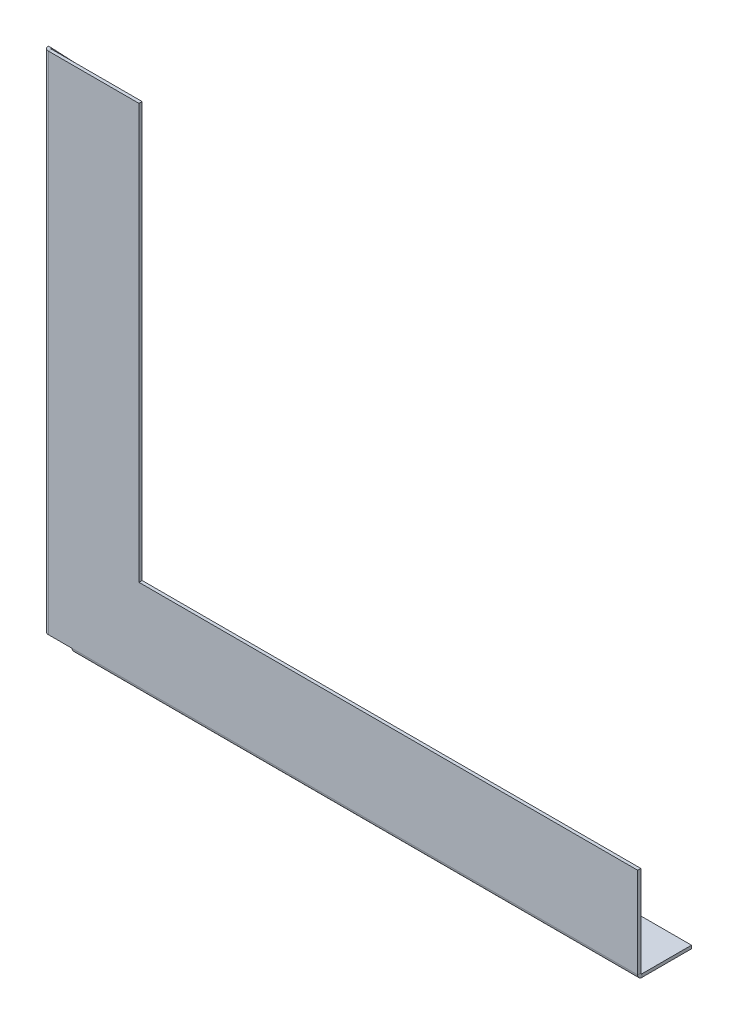
ISO-10303-21;
HEADER;
FILE_DESCRIPTION(('STEP AP214'),'2;1');
FILE_NAME('part.step','',(''),(''),'','','');
FILE_SCHEMA(('AUTOMOTIVE_DESIGN { 1 0 10303 214 1 1 1 1 }'));
ENDSEC;
DATA;
#1=APPLICATION_CONTEXT('core data for automotive mechanical design processes');
#2=APPLICATION_PROTOCOL_DEFINITION('international standard','automotive_design',2000,#1);
#3=PRODUCT_CONTEXT('',#1,'mechanical');
#4=PRODUCT('Part','Part','',(#3));
#5=PRODUCT_RELATED_PRODUCT_CATEGORY('part','',(#4));
#6=PRODUCT_DEFINITION_FORMATION('','',#4);
#7=PRODUCT_DEFINITION_CONTEXT('part definition',#1,'design');
#8=PRODUCT_DEFINITION('design','',#6,#7);
#9=PRODUCT_DEFINITION_SHAPE('','',#8);
#10=(LENGTH_UNIT() NAMED_UNIT(*) SI_UNIT(.MILLI.,.METRE.));
#11=(NAMED_UNIT(*) PLANE_ANGLE_UNIT() SI_UNIT($,.RADIAN.));
#12=(NAMED_UNIT(*) SI_UNIT($,.STERADIAN.) SOLID_ANGLE_UNIT());
#13=UNCERTAINTY_MEASURE_WITH_UNIT(LENGTH_MEASURE(1.E-05),#10,'distance_accuracy_value','');
#14=(GEOMETRIC_REPRESENTATION_CONTEXT(3) GLOBAL_UNCERTAINTY_ASSIGNED_CONTEXT((#13)) GLOBAL_UNIT_ASSIGNED_CONTEXT((#10,
#11,#12)) REPRESENTATION_CONTEXT('',''));
#15=CARTESIAN_POINT('',(0.,0.,0.));
#16=DIRECTION('',(0.,0.,1.));
#17=DIRECTION('',(1.,0.,0.));
#18=AXIS2_PLACEMENT_3D('',#15,#16,#17);
#19=CARTESIAN_POINT('',(-114.828433550695,46.3205731721392,2.));
#20=DIRECTION('',(0.,0.,-1.));
#21=DIRECTION('',(-1.,0.,0.));
#22=AXIS2_PLACEMENT_3D('',#19,#20,#21);
#23=PLANE('',#22);
#24=DIRECTION('',(0.,-1.,0.));
#25=VECTOR('',#24,1.);
#26=CARTESIAN_POINT('',(-97.0918335493792,-272.939426827861,2.0000000784635));
#27=LINE('',#26,#25);
#28=CARTESIAN_POINT('',(-97.0918335493792,-272.939426827861,2.0000000784635));
#29=VERTEX_POINT('',#28);
#30=CARTESIAN_POINT('',(-97.0918335493792,-272.942826827861,2.0000000784635));
#31=VERTEX_POINT('',#30);
#32=EDGE_CURVE('E310',#29,#31,#27,.T.);
#33=ORIENTED_EDGE('',*,*,#32,.T.);
#34=DIRECTION('',(1.,0.,0.));
#35=VECTOR('',#34,1.);
#36=CARTESIAN_POINT('',(-112.091833550695,-272.942826827861,2.00000000000005));
#37=LINE('',#36,#35);
#38=CARTESIAN_POINT('',(260.171566450621,-272.942826827861,2.00000009552911));
#39=VERTEX_POINT('',#38);
#40=EDGE_CURVE('E365',#31,#39,#37,.T.);
#41=ORIENTED_EDGE('',*,*,#40,.T.);
#42=DIRECTION('',(0.,-1.,0.));
#43=VECTOR('',#42,1.);
#44=CARTESIAN_POINT('',(260.171566450621,-215.679426827861,2.));
#45=LINE('',#44,#43);
#46=CARTESIAN_POINT('',(260.171566450621,-215.679426827861,2.));
#47=VERTEX_POINT('',#46);
#48=EDGE_CURVE('E315',#47,#39,#45,.T.);
#49=ORIENTED_EDGE('',*,*,#48,.F.);
#50=DIRECTION('',(-1.,0.,0.));
#51=VECTOR('',#50,1.);
#52=CARTESIAN_POINT('',(-54.8284335506954,-215.679426827861,2.));
#53=LINE('',#52,#51);
#54=CARTESIAN_POINT('',(-54.8284335506954,-215.679426827861,2.));
#55=VERTEX_POINT('',#54);
#56=EDGE_CURVE('E319',#47,#55,#53,.T.);
#57=ORIENTED_EDGE('',*,*,#56,.T.);
#58=DIRECTION('',(0.,1.,0.));
#59=VECTOR('',#58,1.);
#60=CARTESIAN_POINT('',(-54.8284335506954,46.3205731721392,2.));
#61=LINE('',#60,#59);
#62=CARTESIAN_POINT('',(-54.8284335506954,46.3205731721392,2.));
#63=VERTEX_POINT('',#62);
#64=EDGE_CURVE('E321',#55,#63,#61,.T.);
#65=ORIENTED_EDGE('',*,*,#64,.T.);
#66=DIRECTION('',(-1.,0.,0.));
#67=VECTOR('',#66,1.);
#68=CARTESIAN_POINT('',(-114.828433550695,46.3205731721392,2.));
#69=LINE('',#68,#67);
#70=CARTESIAN_POINT('',(-112.091833550695,46.3205731721392,2.0000000784635));
#71=VERTEX_POINT('',#70);
#72=EDGE_CURVE('E324',#63,#71,#69,.T.);
#73=ORIENTED_EDGE('',*,*,#72,.T.);
#74=DIRECTION('',(0.,-1.,0.));
#75=VECTOR('',#74,1.);
#76=CARTESIAN_POINT('',(-112.091833550695,46.3205731721392,2.));
#77=LINE('',#76,#75);
#78=CARTESIAN_POINT('',(-112.091833550695,-272.939426827861,2.0000000784635));
#79=VERTEX_POINT('',#78);
#80=EDGE_CURVE('E338',#71,#79,#77,.T.);
#81=ORIENTED_EDGE('',*,*,#80,.T.);
#82=DIRECTION('',(-1.,0.,0.));
#83=VECTOR('',#82,1.);
#84=CARTESIAN_POINT('',(-112.091833549379,-272.939426827861,2.0000000784635));
#85=LINE('',#84,#83);
#86=EDGE_CURVE('E309',#29,#79,#85,.T.);
#87=ORIENTED_EDGE('',*,*,#86,.F.);
#88=EDGE_LOOP('',(#33,#41,#49,#57,#65,#73,#81,#87));
#89=FACE_BOUND('',#88,.T.);
#90=ADVANCED_FACE('F88',(#89),#23,.F.);
#91=CARTESIAN_POINT('',(-114.828433550695,46.3205731721392,0.));
#92=DIRECTION('',(0.,0.,-1.));
#93=DIRECTION('',(-1.,0.,0.));
#94=AXIS2_PLACEMENT_3D('',#91,#92,#93);
#95=PLANE('',#94);
#96=DIRECTION('',(1.,0.,0.));
#97=VECTOR('',#96,1.);
#98=CARTESIAN_POINT('',(-112.091833550695,-272.942826827861,0.));
#99=LINE('',#98,#97);
#100=CARTESIAN_POINT('',(-97.0918335493792,-272.942826827861,1.91058133289929E-07));
#101=VERTEX_POINT('',#100);
#102=CARTESIAN_POINT('',(260.171566450621,-272.942826827861,0.));
#103=VERTEX_POINT('',#102);
#104=EDGE_CURVE('E96',#101,#103,#99,.T.);
#105=ORIENTED_EDGE('',*,*,#104,.F.);
#106=DIRECTION('',(0.,1.,0.));
#107=VECTOR('',#106,1.);
#108=CARTESIAN_POINT('',(-97.0918335493792,46.3205731721392,0.));
#109=LINE('',#108,#107);
#110=CARTESIAN_POINT('',(-97.0918335493792,-272.939426827861,0.));
#111=VERTEX_POINT('',#110);
#112=EDGE_CURVE('E111',#111,#101,#109,.F.);
#113=ORIENTED_EDGE('',*,*,#112,.F.);
#114=DIRECTION('',(-1.,0.,0.));
#115=VECTOR('',#114,1.);
#116=CARTESIAN_POINT('',(-114.828433550695,-272.939426827861,0.));
#117=LINE('',#116,#115);
#118=CARTESIAN_POINT('',(-112.091833549379,-272.939426827861,0.));
#119=VERTEX_POINT('',#118);
#120=EDGE_CURVE('E308',#111,#119,#117,.T.);
#121=ORIENTED_EDGE('',*,*,#120,.T.);
#122=DIRECTION('',(0.,-1.,0.));
#123=VECTOR('',#122,1.);
#124=CARTESIAN_POINT('',(-112.091833550695,46.3205731721392,0.));
#125=LINE('',#124,#123);
#126=CARTESIAN_POINT('',(-112.091833550695,46.3205731721392,7.84635017549162E-08));
#127=VERTEX_POINT('',#126);
#128=EDGE_CURVE('E357',#127,#119,#125,.T.);
#129=ORIENTED_EDGE('',*,*,#128,.F.);
#130=DIRECTION('',(-1.,0.,0.));
#131=VECTOR('',#130,1.);
#132=CARTESIAN_POINT('',(-114.828433550695,46.3205731721392,0.));
#133=LINE('',#132,#131);
#134=CARTESIAN_POINT('',(-54.8284335506954,46.3205731721392,0.));
#135=VERTEX_POINT('',#134);
#136=EDGE_CURVE('E322',#135,#127,#133,.T.);
#137=ORIENTED_EDGE('',*,*,#136,.F.);
#138=DIRECTION('',(0.,1.,0.));
#139=VECTOR('',#138,1.);
#140=CARTESIAN_POINT('',(-54.8284335506954,46.3205731721392,0.));
#141=LINE('',#140,#139);
#142=CARTESIAN_POINT('',(-54.8284335506954,-215.679426827861,0.));
#143=VERTEX_POINT('',#142);
#144=EDGE_CURVE('E329',#143,#135,#141,.T.);
#145=ORIENTED_EDGE('',*,*,#144,.F.);
#146=DIRECTION('',(-1.,0.,0.));
#147=VECTOR('',#146,1.);
#148=CARTESIAN_POINT('',(-54.8284335506954,-215.679426827861,0.));
#149=LINE('',#148,#147);
#150=CARTESIAN_POINT('',(260.171566450621,-215.679426827861,0.));
#151=VERTEX_POINT('',#150);
#152=EDGE_CURVE('E318',#151,#143,#149,.T.);
#153=ORIENTED_EDGE('',*,*,#152,.F.);
#154=DIRECTION('',(0.,-1.,0.));
#155=VECTOR('',#154,1.);
#156=CARTESIAN_POINT('',(260.171566450621,-215.679426827861,0.));
#157=LINE('',#156,#155);
#158=EDGE_CURVE('E103',#151,#103,#157,.T.);
#159=ORIENTED_EDGE('',*,*,#158,.T.);
#160=EDGE_LOOP('',(#105,#113,#121,#129,#137,#145,#153,#159));
#161=FACE_BOUND('',#160,.T.);
#162=ADVANCED_FACE('F427',(#161),#95,.T.);
#163=CARTESIAN_POINT('',(-114.828433550695,46.3205731721392,2.));
#164=DIRECTION('',(0.,-1.,0.));
#165=DIRECTION('',(0.,0.,-1.));
#166=AXIS2_PLACEMENT_3D('',#163,#164,#165);
#167=PLANE('',#166);
#168=DIRECTION('',(0.,0.,1.));
#169=VECTOR('',#168,1.);
#170=CARTESIAN_POINT('',(-112.091833550695,46.3205731721392,0.));
#171=LINE('',#170,#169);
#172=EDGE_CURVE('E352',#127,#71,#171,.T.);
#173=ORIENTED_EDGE('',*,*,#172,.T.);
#174=ORIENTED_EDGE('',*,*,#72,.F.);
#175=DIRECTION('',(0.,0.,-1.));
#176=VECTOR('',#175,1.);
#177=CARTESIAN_POINT('',(-54.8284335506954,46.3205731721392,2.));
#178=LINE('',#177,#176);
#179=EDGE_CURVE('E327',#63,#135,#178,.T.);
#180=ORIENTED_EDGE('',*,*,#179,.T.);
#181=ORIENTED_EDGE('',*,*,#136,.T.);
#182=EDGE_LOOP('',(#173,#174,#180,#181));
#183=FACE_BOUND('',#182,.T.);
#184=ADVANCED_FACE('F429',(#183),#167,.F.);
#185=CARTESIAN_POINT('',(-54.8284335506954,-215.679426827861,2.));
#186=DIRECTION('',(0.,-1.,0.));
#187=DIRECTION('',(1.,0.,0.));
#188=AXIS2_PLACEMENT_3D('',#185,#186,#187);
#189=PLANE('',#188);
#190=ORIENTED_EDGE('',*,*,#56,.F.);
#191=DIRECTION('',(0.,0.,1.));
#192=VECTOR('',#191,1.);
#193=CARTESIAN_POINT('',(260.171566450621,-215.679426827861,0.));
#194=LINE('',#193,#192);
#195=EDGE_CURVE('E316',#151,#47,#194,.T.);
#196=ORIENTED_EDGE('',*,*,#195,.F.);
#197=ORIENTED_EDGE('',*,*,#152,.T.);
#198=DIRECTION('',(0.,0.,-1.));
#199=VECTOR('',#198,1.);
#200=CARTESIAN_POINT('',(-54.8284335506954,-215.679426827861,2.));
#201=LINE('',#200,#199);
#202=EDGE_CURVE('E335',#55,#143,#201,.T.);
#203=ORIENTED_EDGE('',*,*,#202,.F.);
#204=EDGE_LOOP('',(#190,#196,#197,#203));
#205=FACE_BOUND('',#204,.T.);
#206=ADVANCED_FACE('F435',(#205),#189,.F.);
#207=CARTESIAN_POINT('',(-54.8284335506954,46.3205731721392,2.));
#208=DIRECTION('',(-1.,0.,0.));
#209=DIRECTION('',(0.,-1.,0.));
#210=AXIS2_PLACEMENT_3D('',#207,#208,#209);
#211=PLANE('',#210);
#212=ORIENTED_EDGE('',*,*,#144,.T.);
#213=ORIENTED_EDGE('',*,*,#179,.F.);
#214=ORIENTED_EDGE('',*,*,#64,.F.);
#215=ORIENTED_EDGE('',*,*,#202,.T.);
#216=EDGE_LOOP('',(#212,#213,#214,#215));
#217=FACE_BOUND('',#216,.T.);
#218=ADVANCED_FACE('F441',(#217),#211,.F.);
#219=CARTESIAN_POINT('',(260.171566450621,-306.934071728975,-320.001));
#220=DIRECTION('',(-1.,0.,0.));
#221=DIRECTION('',(0.,0.,1.));
#222=AXIS2_PLACEMENT_3D('',#219,#220,#221);
#223=PLANE('',#222);
#224=DIRECTION('',(0.,0.,1.));
#225=VECTOR('',#224,1.);
#226=CARTESIAN_POINT('',(260.171566450621,-272.942826827861,0.));
#227=LINE('',#226,#225);
#228=EDGE_CURVE('E15',#103,#39,#227,.T.);
#229=ORIENTED_EDGE('',*,*,#228,.F.);
#230=ORIENTED_EDGE('',*,*,#158,.F.);
#231=ORIENTED_EDGE('',*,*,#195,.T.);
#232=ORIENTED_EDGE('',*,*,#48,.T.);
#233=EDGE_LOOP('',(#229,#230,#231,#232));
#234=FACE_BOUND('',#233,.T.);
#235=ADVANCED_FACE('F90',(#234),#223,.F.);
#236=CARTESIAN_POINT('',(-97.0918335493792,-272.939426827861,2.0000000784635));
#237=DIRECTION('',(1.,0.,0.));
#238=DIRECTION('',(0.,-1.,0.));
#239=AXIS2_PLACEMENT_3D('',#236,#237,#238);
#240=PLANE('',#239);
#241=DIRECTION('',(0.,0.,-1.));
#242=VECTOR('',#241,1.);
#243=CARTESIAN_POINT('',(-97.0918335493792,-272.942826827861,2.0000000784635));
#244=LINE('',#243,#242);
#245=EDGE_CURVE('E369',#31,#101,#244,.T.);
#246=ORIENTED_EDGE('',*,*,#245,.F.);
#247=ORIENTED_EDGE('',*,*,#32,.F.);
#248=DIRECTION('',(0.,0.,1.));
#249=VECTOR('',#248,1.);
#250=CARTESIAN_POINT('',(-97.0918335493792,-272.939426827861,2.0000000784635));
#251=LINE('',#250,#249);
#252=EDGE_CURVE('E313',#29,#111,#251,.F.);
#253=ORIENTED_EDGE('',*,*,#252,.T.);
#254=ORIENTED_EDGE('',*,*,#112,.T.);
#255=EDGE_LOOP('',(#246,#247,#253,#254));
#256=FACE_BOUND('',#255,.T.);
#257=ADVANCED_FACE('F397',(#256),#240,.F.);
#258=CARTESIAN_POINT('',(-112.091833549379,-272.939426827861,2.0000000784635));
#259=DIRECTION('',(0.,-1.,0.));
#260=DIRECTION('',(-1.,0.,0.));
#261=AXIS2_PLACEMENT_3D('',#258,#259,#260);
#262=PLANE('',#261);
#263=ORIENTED_EDGE('',*,*,#86,.T.);
#264=DIRECTION('',(0.,0.,-1.));
#265=VECTOR('',#264,1.);
#266=CARTESIAN_POINT('',(-112.091833549379,-272.939426827861,2.0000000784635));
#267=LINE('',#266,#265);
#268=EDGE_CURVE('E360',#79,#119,#267,.T.);
#269=ORIENTED_EDGE('',*,*,#268,.T.);
#270=ORIENTED_EDGE('',*,*,#120,.F.);
#271=ORIENTED_EDGE('',*,*,#252,.F.);
#272=EDGE_LOOP('',(#263,#269,#270,#271));
#273=FACE_BOUND('',#272,.T.);
#274=ADVANCED_FACE('F402',(#273),#262,.T.);
#275=CARTESIAN_POINT('',(-112.091833550695,-113.311126827861,2.0000000784635));
#276=DIRECTION('',(1.,0.,0.));
#277=DIRECTION('',(0.,1.,0.));
#278=AXIS2_PLACEMENT_3D('',#275,#276,#277);
#279=PLANE('',#278);
#280=ORIENTED_EDGE('',*,*,#268,.F.);
#281=DIRECTION('',(0.,1.,0.));
#282=VECTOR('',#281,1.);
#283=CARTESIAN_POINT('',(-112.091833550695,46.3205731721392,2.0000000784635));
#284=LINE('',#283,#282);
#285=CARTESIAN_POINT('',(-112.091833550695,-272.942826827861,2.00000003923176));
#286=VERTEX_POINT('',#285);
#287=EDGE_CURVE('E294',#286,#79,#284,.T.);
#288=ORIENTED_EDGE('',*,*,#287,.F.);
#289=DIRECTION('',(0.,0.,1.));
#290=VECTOR('',#289,1.);
#291=CARTESIAN_POINT('',(-112.091833550695,-272.942826827861,2.00000003923176));
#292=LINE('',#291,#290);
#293=CARTESIAN_POINT('',(-112.091833550695,-272.942826827861,7.84635017549162E-08));
#294=VERTEX_POINT('',#293);
#295=EDGE_CURVE('E312',#294,#286,#292,.T.);
#296=ORIENTED_EDGE('',*,*,#295,.F.);
#297=DIRECTION('',(0.,-1.,0.));
#298=VECTOR('',#297,1.);
#299=CARTESIAN_POINT('',(-112.091833550695,-113.311126827861,7.84635017549162E-08));
#300=LINE('',#299,#298);
#301=EDGE_CURVE('E304',#294,#119,#300,.F.);
#302=ORIENTED_EDGE('',*,*,#301,.T.);
#303=EDGE_LOOP('',(#280,#288,#296,#302));
#304=FACE_BOUND('',#303,.T.);
#305=ADVANCED_FACE('F421',(#304),#279,.T.);
#306=CARTESIAN_POINT('',(-112.091833550695,-272.942826827861,-0.736600078463507));
#307=DIRECTION('',(0.,-1.,0.));
#308=DIRECTION('',(0.,0.,-1.));
#309=AXIS2_PLACEMENT_3D('',#306,#307,#308);
#310=PLANE('',#309);
#311=DIRECTION('',(0.999999999999998,-3.36286554158959E-10,-6.41275839396471E-08));
#312=VECTOR('',#311,1.);
#313=CARTESIAN_POINT('',(-114.828433451112,-272.942826826761,-0.736599971328092));
#314=LINE('',#313,#312);
#315=CARTESIAN_POINT('',(-114.828433451112,-272.942826827861,-0.736600000000018));
#316=VERTEX_POINT('',#315);
#317=CARTESIAN_POINT('',(-112.828433451112,-272.942826827434,-0.736600099583262));
#318=VERTEX_POINT('',#317);
#319=EDGE_CURVE('E286',#316,#318,#314,.T.);
#320=ORIENTED_EDGE('',*,*,#319,.T.);
#321=CARTESIAN_POINT('',(-112.091833550695,-272.942826827861,-0.736600000000003));
#322=DIRECTION('',(0.,-1.,0.));
#323=DIRECTION('',(0.,0.,-1.));
#324=AXIS2_PLACEMENT_3D('',#321,#322,#323);
#325=CIRCLE('',#324,0.736600078463504);
#326=EDGE_CURVE('E260',#318,#294,#325,.F.);
#327=ORIENTED_EDGE('',*,*,#326,.T.);
#328=ORIENTED_EDGE('',*,*,#295,.T.);
#329=CARTESIAN_POINT('',(-112.091833550695,-272.942826827861,-0.736600078463507));
#330=DIRECTION('',(0.,1.,0.));
#331=DIRECTION('',(0.,0.,1.));
#332=AXIS2_PLACEMENT_3D('',#329,#330,#331);
#333=CIRCLE('',#332,2.73660011769526);
#334=EDGE_CURVE('E291',#316,#286,#333,.T.);
#335=ORIENTED_EDGE('',*,*,#334,.F.);
#336=EDGE_LOOP('',(#320,#327,#328,#335));
#337=FACE_BOUND('',#336,.T.);
#338=ADVANCED_FACE('F464',(#337),#310,.T.);
#339=CARTESIAN_POINT('',(-112.091833550695,46.3205731721392,-0.736600078463507));
#340=DIRECTION('',(9.97155289873802E-11,1.,0.));
#341=DIRECTION('',(-1.,9.97155289873802E-11,0.));
#342=AXIS2_PLACEMENT_3D('',#339,#340,#341);
#343=PLANE('',#342);
#344=ORIENTED_EDGE('',*,*,#172,.F.);
#345=CARTESIAN_POINT('',(-112.091833550695,46.3205731721392,-0.736600078463507));
#346=DIRECTION('',(-9.97155289873802E-11,-1.,0.));
#347=DIRECTION('',(1.,-9.97155289873802E-11,0.));
#348=AXIS2_PLACEMENT_3D('',#345,#346,#347);
#349=CIRCLE('',#348,0.736600078463504);
#350=CARTESIAN_POINT('',(-112.828433451112,46.320573172566,-0.736600099583262));
#351=VERTEX_POINT('',#350);
#352=EDGE_CURVE('E295',#127,#351,#349,.T.);
#353=ORIENTED_EDGE('',*,*,#352,.T.);
#354=DIRECTION('',(-1.,0.,0.));
#355=VECTOR('',#354,1.);
#356=CARTESIAN_POINT('',(-112.828433451112,46.320573172566,-0.736600099583262));
#357=LINE('',#356,#355);
#358=CARTESIAN_POINT('',(-114.828433668391,46.320573172412,-0.736600000000015));
#359=VERTEX_POINT('',#358);
#360=EDGE_CURVE('E280',#351,#359,#357,.T.);
#361=ORIENTED_EDGE('',*,*,#360,.T.);
#362=CARTESIAN_POINT('',(-112.091833550695,46.3205731721392,-0.736600078463507));
#363=DIRECTION('',(-9.97155289873802E-11,-1.,0.));
#364=DIRECTION('',(1.,-9.97155289873802E-11,0.));
#365=AXIS2_PLACEMENT_3D('',#362,#363,#364);
#366=CIRCLE('',#365,2.73660011769526);
#367=EDGE_CURVE('E298',#71,#359,#366,.T.);
#368=ORIENTED_EDGE('',*,*,#367,.F.);
#369=EDGE_LOOP('',(#344,#353,#361,#368));
#370=FACE_BOUND('',#369,.T.);
#371=ADVANCED_FACE('F410',(#370),#343,.T.);
#372=CARTESIAN_POINT('',(-112.091833550695,205.970190692667,-0.736600000000003));
#373=DIRECTION('',(0.,-1.,0.));
#374=DIRECTION('',(0.,0.,-1.));
#375=AXIS2_PLACEMENT_3D('',#372,#373,#374);
#376=CYLINDRICAL_SURFACE('',#375,2.7366000784635);
#377=ORIENTED_EDGE('',*,*,#367,.T.);
#378=DIRECTION('',(0.,-1.,0.));
#379=VECTOR('',#378,1.);
#380=CARTESIAN_POINT('',(-114.828433451112,-275.679426827434,-0.736600099583262));
#381=LINE('',#380,#379);
#382=EDGE_CURVE('E251',#359,#316,#381,.T.);
#383=ORIENTED_EDGE('',*,*,#382,.T.);
#384=ORIENTED_EDGE('',*,*,#334,.T.);
#385=ORIENTED_EDGE('',*,*,#287,.T.);
#386=ORIENTED_EDGE('',*,*,#80,.F.);
#387=EDGE_LOOP('',(#377,#383,#384,#385,#386));
#388=FACE_BOUND('',#387,.T.);
#389=ADVANCED_FACE('F407',(#388),#376,.T.);
#390=CARTESIAN_POINT('',(-112.091833550695,205.970190692667,-0.736600000000003));
#391=DIRECTION('',(0.,-1.,0.));
#392=DIRECTION('',(0.,0.,-1.));
#393=AXIS2_PLACEMENT_3D('',#390,#391,#392);
#394=CYLINDRICAL_SURFACE('',#393,0.736600078463504);
#395=ORIENTED_EDGE('',*,*,#352,.F.);
#396=ORIENTED_EDGE('',*,*,#128,.T.);
#397=ORIENTED_EDGE('',*,*,#301,.F.);
#398=ORIENTED_EDGE('',*,*,#326,.F.);
#399=DIRECTION('',(0.,1.,0.));
#400=VECTOR('',#399,1.);
#401=CARTESIAN_POINT('',(-112.828433451112,-275.679426827434,-0.736600099583262));
#402=LINE('',#401,#400);
#403=EDGE_CURVE('E283',#318,#351,#402,.T.);
#404=ORIENTED_EDGE('',*,*,#403,.T.);
#405=EDGE_LOOP('',(#395,#396,#397,#398,#404));
#406=FACE_BOUND('',#405,.T.);
#407=ADVANCED_FACE('F425',(#406),#394,.F.);
#408=CARTESIAN_POINT('',(-114.828433451112,-275.679426827434,-15.0000000995832));
#409=DIRECTION('',(0.,0.,1.));
#410=DIRECTION('',(1.,0.,0.));
#411=AXIS2_PLACEMENT_3D('',#408,#409,#410);
#412=PLANE('',#411);
#413=DIRECTION('',(0.,1.,0.));
#414=VECTOR('',#413,1.);
#415=CARTESIAN_POINT('',(-112.828433451112,-275.679426827434,-15.0000000995833));
#416=LINE('',#415,#414);
#417=CARTESIAN_POINT('',(-112.828433451112,31.3205731725659,-15.0000000995833));
#418=VERTEX_POINT('',#417);
#419=CARTESIAN_POINT('',(-112.828433451112,-272.942826826761,-15.0000000995832));
#420=VERTEX_POINT('',#419);
#421=EDGE_CURVE('E277',#418,#420,#416,.F.);
#422=ORIENTED_EDGE('',*,*,#421,.T.);
#423=DIRECTION('',(-1.,0.,0.));
#424=VECTOR('',#423,1.);
#425=CARTESIAN_POINT('',(-112.088433451112,-272.942826826761,-15.0000000995832));
#426=LINE('',#425,#424);
#427=CARTESIAN_POINT('',(-114.828433451112,-272.942826826761,-15.0000000995832));
#428=VERTEX_POINT('',#427);
#429=EDGE_CURVE('E274',#420,#428,#426,.T.);
#430=ORIENTED_EDGE('',*,*,#429,.T.);
#431=DIRECTION('',(0.,-1.,0.));
#432=VECTOR('',#431,1.);
#433=CARTESIAN_POINT('',(-114.828433451112,-275.679426827434,-15.0000000995832));
#434=LINE('',#433,#432);
#435=CARTESIAN_POINT('',(-114.828433451112,31.3205731725659,-15.0000000995832));
#436=VERTEX_POINT('',#435);
#437=EDGE_CURVE('E268',#436,#428,#434,.T.);
#438=ORIENTED_EDGE('',*,*,#437,.F.);
#439=DIRECTION('',(-1.,0.,0.));
#440=VECTOR('',#439,1.);
#441=CARTESIAN_POINT('',(-114.828433451112,31.3205731725659,-15.0000000995832));
#442=LINE('',#441,#440);
#443=EDGE_CURVE('E271',#436,#418,#442,.F.);
#444=ORIENTED_EDGE('',*,*,#443,.T.);
#445=EDGE_LOOP('',(#422,#430,#438,#444));
#446=FACE_BOUND('',#445,.T.);
#447=ADVANCED_FACE('F473',(#446),#412,.F.);
#448=CARTESIAN_POINT('',(-114.828433451112,-275.679426827434,-9.95832583061684E-08));
#449=DIRECTION('',(1.,0.,0.));
#450=DIRECTION('',(0.,0.,-1.));
#451=AXIS2_PLACEMENT_3D('',#448,#449,#450);
#452=PLANE('',#451);
#453=ORIENTED_EDGE('',*,*,#437,.T.);
#454=DIRECTION('',(0.,0.,-1.));
#455=VECTOR('',#454,1.);
#456=CARTESIAN_POINT('',(-114.828433451112,-272.942826826761,-0.736599971328092));
#457=LINE('',#456,#455);
#458=EDGE_CURVE('E261',#316,#428,#457,.T.);
#459=ORIENTED_EDGE('',*,*,#458,.F.);
#460=ORIENTED_EDGE('',*,*,#382,.F.);
#461=DIRECTION('',(0.,0.724676090432905,0.689089663218713));
#462=VECTOR('',#461,1.);
#463=CARTESIAN_POINT('',(-114.828433451112,31.320573172566,-15.0000000995832));
#464=LINE('',#463,#462);
#465=EDGE_CURVE('E265',#436,#359,#464,.T.);
#466=ORIENTED_EDGE('',*,*,#465,.F.);
#467=EDGE_LOOP('',(#453,#459,#460,#466));
#468=FACE_BOUND('',#467,.T.);
#469=ADVANCED_FACE('F487',(#468),#452,.F.);
#470=CARTESIAN_POINT('',(-114.828433451112,31.320573172566,-15.0000000995832));
#471=DIRECTION('',(0.,0.689089663218713,-0.724676090432905));
#472=DIRECTION('',(0.,0.724676090432905,0.689089663218713));
#473=AXIS2_PLACEMENT_3D('',#470,#471,#472);
#474=PLANE('',#473);
#475=ORIENTED_EDGE('',*,*,#443,.F.);
#476=ORIENTED_EDGE('',*,*,#465,.T.);
#477=ORIENTED_EDGE('',*,*,#360,.F.);
#478=DIRECTION('',(0.,0.724676090432905,0.689089663218713));
#479=VECTOR('',#478,1.);
#480=CARTESIAN_POINT('',(-112.828433451112,31.320573172566,-15.0000000995833));
#481=LINE('',#480,#479);
#482=EDGE_CURVE('E263',#418,#351,#481,.T.);
#483=ORIENTED_EDGE('',*,*,#482,.F.);
#484=EDGE_LOOP('',(#475,#476,#477,#483));
#485=FACE_BOUND('',#484,.T.);
#486=ADVANCED_FACE('F483',(#485),#474,.T.);
#487=CARTESIAN_POINT('',(-112.828433451112,-275.679426827434,-9.95832583061684E-08));
#488=DIRECTION('',(1.,0.,0.));
#489=DIRECTION('',(0.,0.,-1.));
#490=AXIS2_PLACEMENT_3D('',#487,#488,#489);
#491=PLANE('',#490);
#492=DIRECTION('',(0.,0.,1.));
#493=VECTOR('',#492,1.);
#494=CARTESIAN_POINT('',(-112.828433451112,-272.942826826761,-9.95832583061684E-08));
#495=LINE('',#494,#493);
#496=EDGE_CURVE('E258',#420,#318,#495,.T.);
#497=ORIENTED_EDGE('',*,*,#496,.F.);
#498=ORIENTED_EDGE('',*,*,#421,.F.);
#499=ORIENTED_EDGE('',*,*,#482,.T.);
#500=ORIENTED_EDGE('',*,*,#403,.F.);
#501=EDGE_LOOP('',(#497,#498,#499,#500));
#502=FACE_BOUND('',#501,.T.);
#503=ADVANCED_FACE('F479',(#502),#491,.T.);
#504=CARTESIAN_POINT('',(-112.091833500904,-272.942826826761,-0.736600128255119));
#505=DIRECTION('',(0.,-1.,0.));
#506=DIRECTION('',(0.,0.,-1.));
#507=AXIS2_PLACEMENT_3D('',#504,#505,#506);
#508=PLANE('',#507);
#509=ORIENTED_EDGE('',*,*,#319,.F.);
#510=ORIENTED_EDGE('',*,*,#458,.T.);
#511=ORIENTED_EDGE('',*,*,#429,.F.);
#512=ORIENTED_EDGE('',*,*,#496,.T.);
#513=EDGE_LOOP('',(#509,#510,#511,#512));
#514=FACE_BOUND('',#513,.T.);
#515=ADVANCED_FACE('F476',(#514),#508,.T.);
#516=CARTESIAN_POINT('',(260.171566450621,-272.942826827861,-0.736600191058028));
#517=DIRECTION('',(1.,0.,0.));
#518=DIRECTION('',(0.,0.,-1.));
#519=AXIS2_PLACEMENT_3D('',#516,#517,#518);
#520=PLANE('',#519);
#521=DIRECTION('',(0.,1.,0.));
#522=VECTOR('',#521,1.);
#523=CARTESIAN_POINT('',(260.171566450621,-275.67942675641,-0.736599992987086));
#524=LINE('',#523,#522);
#525=CARTESIAN_POINT('',(260.17156645062,-275.679427018919,-0.736599808941946));
#526=VERTEX_POINT('',#525);
#527=CARTESIAN_POINT('',(260.171566450621,-273.67942675641,-0.736599992987141));
#528=VERTEX_POINT('',#527);
#529=EDGE_CURVE('E238',#526,#528,#524,.T.);
#530=ORIENTED_EDGE('',*,*,#529,.T.);
#531=CARTESIAN_POINT('',(260.17156645062,-272.942826827861,-0.736599999999947));
#532=DIRECTION('',(1.,0.,0.));
#533=DIRECTION('',(0.,0.,-1.));
#534=AXIS2_PLACEMENT_3D('',#531,#532,#533);
#535=CIRCLE('',#534,0.73660019105808);
#536=EDGE_CURVE('E252',#528,#103,#535,.F.);
#537=ORIENTED_EDGE('',*,*,#536,.T.);
#538=ORIENTED_EDGE('',*,*,#228,.T.);
#539=CARTESIAN_POINT('',(260.171566450621,-272.942826827861,-0.736600191058028));
#540=DIRECTION('',(-1.,0.,0.));
#541=DIRECTION('',(0.,0.,1.));
#542=AXIS2_PLACEMENT_3D('',#539,#540,#541);
#543=CIRCLE('',#542,2.73660028658714);
#544=EDGE_CURVE('E244',#526,#39,#543,.T.);
#545=ORIENTED_EDGE('',*,*,#544,.F.);
#546=EDGE_LOOP('',(#530,#537,#538,#545));
#547=FACE_BOUND('',#546,.T.);
#548=ADVANCED_FACE('F377',(#547),#520,.T.);
#549=CARTESIAN_POINT('',(-97.0918335493792,-272.942826827861,-0.736600191058028));
#550=DIRECTION('',(-1.,0.,0.));
#551=DIRECTION('',(0.,0.,1.));
#552=AXIS2_PLACEMENT_3D('',#549,#550,#551);
#553=PLANE('',#552);
#554=CARTESIAN_POINT('',(-97.0918335493792,-272.942826827861,-0.736599999999947));
#555=DIRECTION('',(1.,0.,0.));
#556=DIRECTION('',(0.,0.,-1.));
#557=AXIS2_PLACEMENT_3D('',#554,#555,#556);
#558=CIRCLE('',#557,0.73660019105808);
#559=CARTESIAN_POINT('',(-97.0918335493792,-273.67942675641,-0.736599992987141));
#560=VERTEX_POINT('',#559);
#561=EDGE_CURVE('E248',#101,#560,#558,.T.);
#562=ORIENTED_EDGE('',*,*,#561,.T.);
#563=DIRECTION('',(0.,1.,0.));
#564=VECTOR('',#563,1.);
#565=CARTESIAN_POINT('',(-97.0918335493792,-275.67942675641,-0.736599992987086));
#566=LINE('',#565,#564);
#567=CARTESIAN_POINT('',(-97.0918335493792,-275.67942675641,-0.736599992987086));
#568=VERTEX_POINT('',#567);
#569=EDGE_CURVE('E214',#568,#560,#566,.T.);
#570=ORIENTED_EDGE('',*,*,#569,.F.);
#571=CARTESIAN_POINT('',(-97.0918335493792,-272.942826827861,-0.736600191058028));
#572=DIRECTION('',(1.,0.,0.));
#573=DIRECTION('',(0.,0.,-1.));
#574=AXIS2_PLACEMENT_3D('',#571,#572,#573);
#575=CIRCLE('',#574,2.73660028658713);
#576=EDGE_CURVE('E247',#31,#568,#575,.T.);
#577=ORIENTED_EDGE('',*,*,#576,.F.);
#578=ORIENTED_EDGE('',*,*,#245,.T.);
#579=EDGE_LOOP('',(#562,#570,#577,#578));
#580=FACE_BOUND('',#579,.T.);
#581=ADVANCED_FACE('F392',(#580),#553,.T.);
#582=CARTESIAN_POINT('',(-275.739545379502,-272.942826827861,-0.736599999999947));
#583=DIRECTION('',(1.,0.,0.));
#584=DIRECTION('',(0.,0.,-1.));
#585=AXIS2_PLACEMENT_3D('',#582,#583,#584);
#586=CYLINDRICAL_SURFACE('',#585,2.73660019105808);
#587=ORIENTED_EDGE('',*,*,#40,.F.);
#588=ORIENTED_EDGE('',*,*,#576,.T.);
#589=DIRECTION('',(1.,0.,0.));
#590=VECTOR('',#589,1.);
#591=CARTESIAN_POINT('',(285.171566450621,-275.67942675641,-0.736599992987141));
#592=LINE('',#591,#590);
#593=EDGE_CURVE('E241',#568,#526,#592,.T.);
#594=ORIENTED_EDGE('',*,*,#593,.T.);
#595=ORIENTED_EDGE('',*,*,#544,.T.);
#596=EDGE_LOOP('',(#587,#588,#594,#595));
#597=FACE_BOUND('',#596,.T.);
#598=ADVANCED_FACE('F389',(#597),#586,.T.);
#599=CARTESIAN_POINT('',(-275.739545379502,-272.942826827861,-0.736599999999947));
#600=DIRECTION('',(1.,0.,0.));
#601=DIRECTION('',(0.,0.,-1.));
#602=AXIS2_PLACEMENT_3D('',#599,#600,#601);
#603=CYLINDRICAL_SURFACE('',#602,0.73660019105808);
#604=ORIENTED_EDGE('',*,*,#104,.T.);
#605=ORIENTED_EDGE('',*,*,#536,.F.);
#606=DIRECTION('',(-1.,0.,0.));
#607=VECTOR('',#606,1.);
#608=CARTESIAN_POINT('',(285.171566450621,-273.67942675641,-0.736599992987141));
#609=LINE('',#608,#607);
#610=EDGE_CURVE('E228',#528,#560,#609,.T.);
#611=ORIENTED_EDGE('',*,*,#610,.T.);
#612=ORIENTED_EDGE('',*,*,#561,.F.);
#613=EDGE_LOOP('',(#604,#605,#611,#612));
#614=FACE_BOUND('',#613,.T.);
#615=ADVANCED_FACE('F375',(#614),#603,.F.);
#616=CARTESIAN_POINT('',(285.171566450621,-275.67942675641,-31.9999999929871));
#617=DIRECTION('',(0.,0.,1.));
#618=DIRECTION('',(0.,-1.,0.));
#619=AXIS2_PLACEMENT_3D('',#616,#617,#618);
#620=PLANE('',#619);
#621=DIRECTION('',(0.,-1.,0.));
#622=VECTOR('',#621,1.);
#623=CARTESIAN_POINT('',(-97.0918335493792,-275.67942675641,-31.9999999929871));
#624=LINE('',#623,#622);
#625=CARTESIAN_POINT('',(-97.0918335493792,-275.67942675641,-31.9999999929871));
#626=VERTEX_POINT('',#625);
#627=CARTESIAN_POINT('',(-97.0918335493792,-273.67942675641,-31.9999999929871));
#628=VERTEX_POINT('',#627);
#629=EDGE_CURVE('E211',#626,#628,#624,.F.);
#630=ORIENTED_EDGE('',*,*,#629,.T.);
#631=DIRECTION('',(-1.,0.,0.));
#632=VECTOR('',#631,1.);
#633=CARTESIAN_POINT('',(285.171566450621,-273.67942675641,-31.9999999929871));
#634=LINE('',#633,#632);
#635=CARTESIAN_POINT('',(260.171566450621,-273.67942675641,-31.9999999929871));
#636=VERTEX_POINT('',#635);
#637=EDGE_CURVE('E225',#628,#636,#634,.F.);
#638=ORIENTED_EDGE('',*,*,#637,.T.);
#639=DIRECTION('',(0.,-1.,0.));
#640=VECTOR('',#639,1.);
#641=CARTESIAN_POINT('',(260.171566450621,46.3215732435897,-31.9999999929882));
#642=LINE('',#641,#640);
#643=CARTESIAN_POINT('',(260.171566450621,-275.67942675641,-31.9999999929871));
#644=VERTEX_POINT('',#643);
#645=EDGE_CURVE('E232',#636,#644,#642,.T.);
#646=ORIENTED_EDGE('',*,*,#645,.T.);
#647=DIRECTION('',(1.,0.,0.));
#648=VECTOR('',#647,1.);
#649=CARTESIAN_POINT('',(-112.091833549379,-275.67942675641,-31.9999999929871));
#650=LINE('',#649,#648);
#651=EDGE_CURVE('E227',#626,#644,#650,.T.);
#652=ORIENTED_EDGE('',*,*,#651,.F.);
#653=EDGE_LOOP('',(#630,#638,#646,#652));
#654=FACE_BOUND('',#653,.T.);
#655=ADVANCED_FACE('F223',(#654),#620,.F.);
#656=CARTESIAN_POINT('',(-112.091833549379,-275.67942675641,7.01283475734726E-09));
#657=DIRECTION('',(0.,1.,0.));
#658=DIRECTION('',(0.,0.,1.));
#659=AXIS2_PLACEMENT_3D('',#656,#657,#658);
#660=PLANE('',#659);
#661=DIRECTION('',(0.,0.,1.));
#662=VECTOR('',#661,1.);
#663=CARTESIAN_POINT('',(-97.0918335493792,-275.67942675641,-31.9999999929871));
#664=LINE('',#663,#662);
#665=EDGE_CURVE('E393',#626,#568,#664,.T.);
#666=ORIENTED_EDGE('',*,*,#665,.F.);
#667=ORIENTED_EDGE('',*,*,#651,.T.);
#668=DIRECTION('',(0.,0.,-1.));
#669=VECTOR('',#668,1.);
#670=CARTESIAN_POINT('',(260.171566450621,-275.67942675641,-31.9999999929871));
#671=LINE('',#670,#669);
#672=EDGE_CURVE('E255',#526,#644,#671,.T.);
#673=ORIENTED_EDGE('',*,*,#672,.F.);
#674=ORIENTED_EDGE('',*,*,#593,.F.);
#675=EDGE_LOOP('',(#666,#667,#673,#674));
#676=FACE_BOUND('',#675,.T.);
#677=ADVANCED_FACE('F385',(#676),#660,.F.);
#678=CARTESIAN_POINT('',(-97.0918335493792,-275.67942675641,-31.9999999929871));
#679=DIRECTION('',(-1.,0.,0.));
#680=DIRECTION('',(0.,0.,1.));
#681=AXIS2_PLACEMENT_3D('',#678,#679,#680);
#682=PLANE('',#681);
#683=ORIENTED_EDGE('',*,*,#629,.F.);
#684=ORIENTED_EDGE('',*,*,#665,.T.);
#685=ORIENTED_EDGE('',*,*,#569,.T.);
#686=DIRECTION('',(0.,0.,1.));
#687=VECTOR('',#686,1.);
#688=CARTESIAN_POINT('',(-97.0918335493792,-273.67942675641,7.01283475734726E-09));
#689=LINE('',#688,#687);
#690=EDGE_CURVE('E208',#628,#560,#689,.T.);
#691=ORIENTED_EDGE('',*,*,#690,.F.);
#692=EDGE_LOOP('',(#683,#684,#685,#691));
#693=FACE_BOUND('',#692,.T.);
#694=ADVANCED_FACE('F210',(#693),#682,.T.);
#695=CARTESIAN_POINT('',(-112.091833549379,-273.67942675641,7.01283475734726E-09));
#696=DIRECTION('',(0.,1.,0.));
#697=DIRECTION('',(0.,0.,1.));
#698=AXIS2_PLACEMENT_3D('',#695,#696,#697);
#699=PLANE('',#698);
#700=ORIENTED_EDGE('',*,*,#637,.F.);
#701=ORIENTED_EDGE('',*,*,#690,.T.);
#702=ORIENTED_EDGE('',*,*,#610,.F.);
#703=DIRECTION('',(0.,0.,-1.));
#704=VECTOR('',#703,1.);
#705=CARTESIAN_POINT('',(260.171566450621,-273.67942675641,-31.9999999929871));
#706=LINE('',#705,#704);
#707=EDGE_CURVE('E219',#528,#636,#706,.T.);
#708=ORIENTED_EDGE('',*,*,#707,.T.);
#709=EDGE_LOOP('',(#700,#701,#702,#708));
#710=FACE_BOUND('',#709,.T.);
#711=ADVANCED_FACE('F231',(#710),#699,.T.);
#712=CARTESIAN_POINT('',(260.171566450621,46.3215732435897,-31.9999999929882));
#713=DIRECTION('',(-1.,0.,0.));
#714=DIRECTION('',(0.,-1.,0.));
#715=AXIS2_PLACEMENT_3D('',#712,#713,#714);
#716=PLANE('',#715);
#717=ORIENTED_EDGE('',*,*,#529,.F.);
#718=ORIENTED_EDGE('',*,*,#672,.T.);
#719=ORIENTED_EDGE('',*,*,#645,.F.);
#720=ORIENTED_EDGE('',*,*,#707,.F.);
#721=EDGE_LOOP('',(#717,#718,#719,#720));
#722=FACE_BOUND('',#721,.T.);
#723=ADVANCED_FACE('F382',(#722),#716,.F.);
#724=CLOSED_SHELL('',(#90,#162,#184,#206,#218,#235,#257,#274,#305,#338,#371,#389,#407,#447,#469,
#486,#503,#515,#548,#581,#598,#615,#655,#677,#694,#711,#723));
#725=MANIFOLD_SOLID_BREP('B2',#724);
#726=ADVANCED_BREP_SHAPE_REPRESENTATION('',(#18,#725),#14);
#727=SHAPE_DEFINITION_REPRESENTATION(#9,#726);
ENDSEC;
END-ISO-10303-21;
